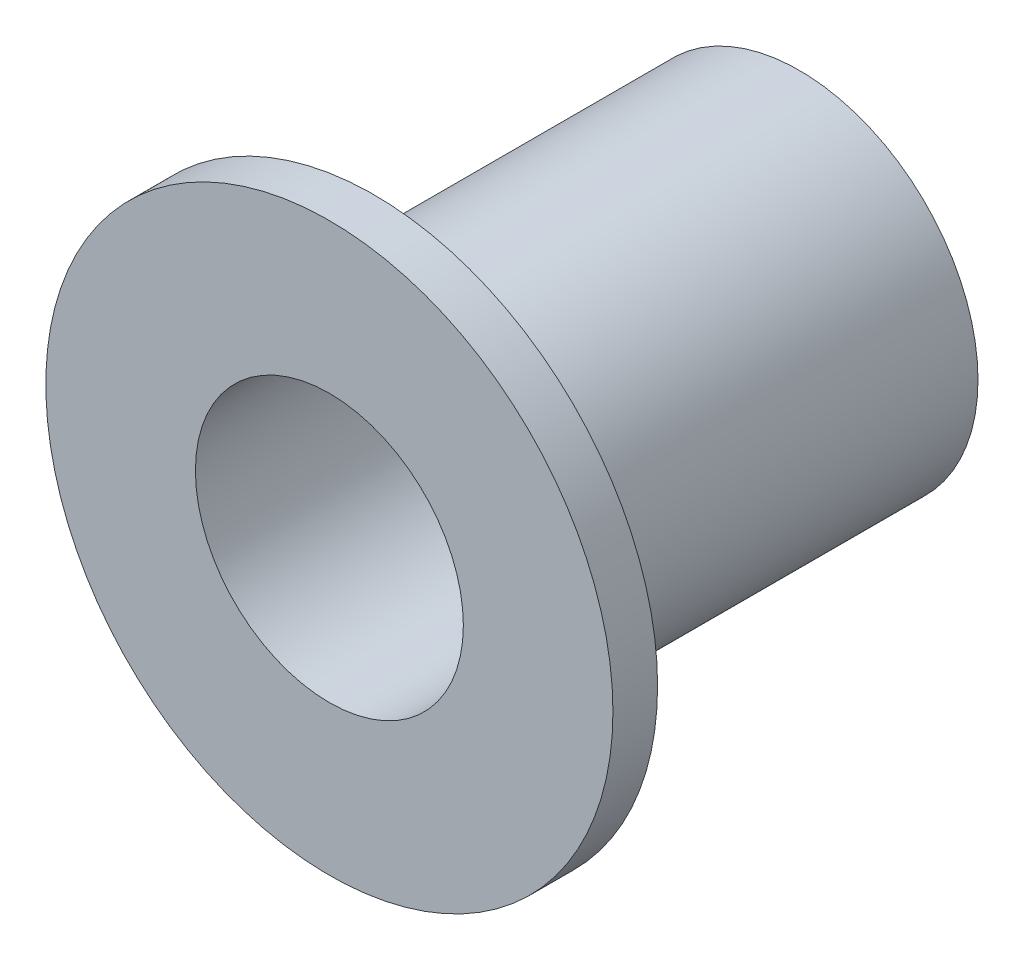
ISO-10303-21;
HEADER;
FILE_DESCRIPTION(('STEP AP214'),'2;1');
FILE_NAME('part.step','',(''),(''),'','','');
FILE_SCHEMA(('AUTOMOTIVE_DESIGN { 1 0 10303 214 1 1 1 1 }'));
ENDSEC;
DATA;
#1=APPLICATION_CONTEXT('core data for automotive mechanical design processes');
#2=APPLICATION_PROTOCOL_DEFINITION('international standard','automotive_design',2000,#1);
#3=PRODUCT_CONTEXT('',#1,'mechanical');
#4=PRODUCT('Part','Part','',(#3));
#5=PRODUCT_RELATED_PRODUCT_CATEGORY('part','',(#4));
#6=PRODUCT_DEFINITION_FORMATION('','',#4);
#7=PRODUCT_DEFINITION_CONTEXT('part definition',#1,'design');
#8=PRODUCT_DEFINITION('design','',#6,#7);
#9=PRODUCT_DEFINITION_SHAPE('','',#8);
#10=(LENGTH_UNIT() NAMED_UNIT(*) SI_UNIT(.MILLI.,.METRE.));
#11=(NAMED_UNIT(*) PLANE_ANGLE_UNIT() SI_UNIT($,.RADIAN.));
#12=(NAMED_UNIT(*) SI_UNIT($,.STERADIAN.) SOLID_ANGLE_UNIT());
#13=UNCERTAINTY_MEASURE_WITH_UNIT(LENGTH_MEASURE(1.E-05),#10,'distance_accuracy_value','');
#14=(GEOMETRIC_REPRESENTATION_CONTEXT(3) GLOBAL_UNCERTAINTY_ASSIGNED_CONTEXT((#13)) GLOBAL_UNIT_ASSIGNED_CONTEXT((#10,
#11,#12)) REPRESENTATION_CONTEXT('',''));
#15=CARTESIAN_POINT('',(0.,0.,0.));
#16=DIRECTION('',(0.,0.,1.));
#17=DIRECTION('',(1.,0.,0.));
#18=AXIS2_PLACEMENT_3D('',#15,#16,#17);
#19=CARTESIAN_POINT('',(0.,0.,0.));
#20=DIRECTION('',(0.,0.,1.));
#21=DIRECTION('',(1.,0.,0.));
#22=AXIS2_PLACEMENT_3D('',#19,#20,#21);
#23=PLANE('',#22);
#24=CARTESIAN_POINT('',(0.,0.,0.));
#25=DIRECTION('',(0.,0.,1.));
#26=DIRECTION('',(1.,0.,0.));
#27=AXIS2_PLACEMENT_3D('',#24,#25,#26);
#28=CIRCLE('',#27,6.35);
#29=CARTESIAN_POINT('',(6.35,0.,0.));
#30=VERTEX_POINT('',#29);
#31=EDGE_CURVE('E43',#30,#30,#28,.T.);
#32=ORIENTED_EDGE('',*,*,#31,.F.);
#33=EDGE_LOOP('',(#32));
#34=FACE_BOUND('',#33,.T.);
#35=CARTESIAN_POINT('',(0.,0.,0.));
#36=DIRECTION('',(0.,0.,1.));
#37=DIRECTION('',(1.,0.,0.));
#38=AXIS2_PLACEMENT_3D('',#35,#36,#37);
#39=CIRCLE('',#38,4.);
#40=CARTESIAN_POINT('',(4.,0.,0.));
#41=VERTEX_POINT('',#40);
#42=EDGE_CURVE('E10',#41,#41,#39,.F.);
#43=ORIENTED_EDGE('',*,*,#42,.F.);
#44=EDGE_LOOP('',(#43));
#45=FACE_BOUND('',#44,.T.);
#46=ADVANCED_FACE('F32',(#34,#45),#23,.F.);
#47=CARTESIAN_POINT('',(0.,0.,1.));
#48=DIRECTION('',(0.,0.,1.));
#49=DIRECTION('',(1.,0.,0.));
#50=AXIS2_PLACEMENT_3D('',#47,#48,#49);
#51=PLANE('',#50);
#52=CARTESIAN_POINT('',(0.,0.,1.));
#53=DIRECTION('',(0.,0.,1.));
#54=DIRECTION('',(1.,0.,0.));
#55=AXIS2_PLACEMENT_3D('',#52,#53,#54);
#56=CIRCLE('',#55,6.35);
#57=CARTESIAN_POINT('',(6.35,0.,1.));
#58=VERTEX_POINT('',#57);
#59=EDGE_CURVE('E39',#58,#58,#56,.T.);
#60=ORIENTED_EDGE('',*,*,#59,.T.);
#61=EDGE_LOOP('',(#60));
#62=FACE_BOUND('',#61,.T.);
#63=CARTESIAN_POINT('',(0.,0.,1.));
#64=DIRECTION('',(0.,0.,1.));
#65=DIRECTION('',(1.,0.,0.));
#66=AXIS2_PLACEMENT_3D('',#63,#64,#65);
#67=CIRCLE('',#66,3.);
#68=CARTESIAN_POINT('',(3.,0.,1.));
#69=VERTEX_POINT('',#68);
#70=EDGE_CURVE('E48',#69,#69,#67,.T.);
#71=ORIENTED_EDGE('',*,*,#70,.F.);
#72=EDGE_LOOP('',(#71));
#73=FACE_BOUND('',#72,.T.);
#74=ADVANCED_FACE('F75',(#62,#73),#51,.T.);
#75=CARTESIAN_POINT('',(0.,0.,1.));
#76=DIRECTION('',(0.,0.,-1.));
#77=DIRECTION('',(-1.,0.,0.));
#78=AXIS2_PLACEMENT_3D('',#75,#76,#77);
#79=CYLINDRICAL_SURFACE('',#78,6.35);
#80=ORIENTED_EDGE('',*,*,#59,.F.);
#81=EDGE_LOOP('',(#80));
#82=FACE_BOUND('',#81,.T.);
#83=ORIENTED_EDGE('',*,*,#31,.T.);
#84=EDGE_LOOP('',(#83));
#85=FACE_BOUND('',#84,.T.);
#86=ADVANCED_FACE('F34',(#82,#85),#79,.T.);
#87=CARTESIAN_POINT('',(0.,0.,1.));
#88=DIRECTION('',(0.,0.,-1.));
#89=DIRECTION('',(-1.,0.,0.));
#90=AXIS2_PLACEMENT_3D('',#87,#88,#89);
#91=CYLINDRICAL_SURFACE('',#90,3.);
#92=ORIENTED_EDGE('',*,*,#70,.T.);
#93=EDGE_LOOP('',(#92));
#94=FACE_BOUND('',#93,.T.);
#95=CARTESIAN_POINT('',(0.,0.,-9.525));
#96=DIRECTION('',(0.,0.,-1.));
#97=DIRECTION('',(-1.,0.,0.));
#98=AXIS2_PLACEMENT_3D('',#95,#96,#97);
#99=CIRCLE('',#98,3.);
#100=CARTESIAN_POINT('',(-3.,0.,-9.525));
#101=VERTEX_POINT('',#100);
#102=EDGE_CURVE('E55',#101,#101,#99,.T.);
#103=ORIENTED_EDGE('',*,*,#102,.T.);
#104=EDGE_LOOP('',(#103));
#105=FACE_BOUND('',#104,.T.);
#106=ADVANCED_FACE('F59',(#94,#105),#91,.F.);
#107=CARTESIAN_POINT('',(0.,0.,-9.525));
#108=DIRECTION('',(0.,0.,-1.));
#109=DIRECTION('',(-1.,0.,0.));
#110=AXIS2_PLACEMENT_3D('',#107,#108,#109);
#111=PLANE('',#110);
#112=CARTESIAN_POINT('',(0.,0.,-9.525));
#113=DIRECTION('',(0.,0.,-1.));
#114=DIRECTION('',(-1.,0.,0.));
#115=AXIS2_PLACEMENT_3D('',#112,#113,#114);
#116=CIRCLE('',#115,4.);
#117=CARTESIAN_POINT('',(-4.,0.,-9.525));
#118=VERTEX_POINT('',#117);
#119=EDGE_CURVE('E52',#118,#118,#116,.T.);
#120=ORIENTED_EDGE('',*,*,#119,.T.);
#121=EDGE_LOOP('',(#120));
#122=FACE_BOUND('',#121,.T.);
#123=ORIENTED_EDGE('',*,*,#102,.F.);
#124=EDGE_LOOP('',(#123));
#125=FACE_BOUND('',#124,.T.);
#126=ADVANCED_FACE('F61',(#122,#125),#111,.T.);
#127=CARTESIAN_POINT('',(0.,0.,-9.525));
#128=DIRECTION('',(0.,0.,1.));
#129=DIRECTION('',(1.,0.,0.));
#130=AXIS2_PLACEMENT_3D('',#127,#128,#129);
#131=CYLINDRICAL_SURFACE('',#130,4.);
#132=ORIENTED_EDGE('',*,*,#119,.F.);
#133=EDGE_LOOP('',(#132));
#134=FACE_BOUND('',#133,.T.);
#135=ORIENTED_EDGE('',*,*,#42,.T.);
#136=EDGE_LOOP('',(#135));
#137=FACE_BOUND('',#136,.T.);
#138=ADVANCED_FACE('F63',(#134,#137),#131,.T.);
#139=CLOSED_SHELL('',(#46,#74,#86,#106,#126,#138));
#140=MANIFOLD_SOLID_BREP('B2',#139);
#141=ADVANCED_BREP_SHAPE_REPRESENTATION('',(#18,#140),#14);
#142=SHAPE_DEFINITION_REPRESENTATION(#9,#141);
ENDSEC;
END-ISO-10303-21;
